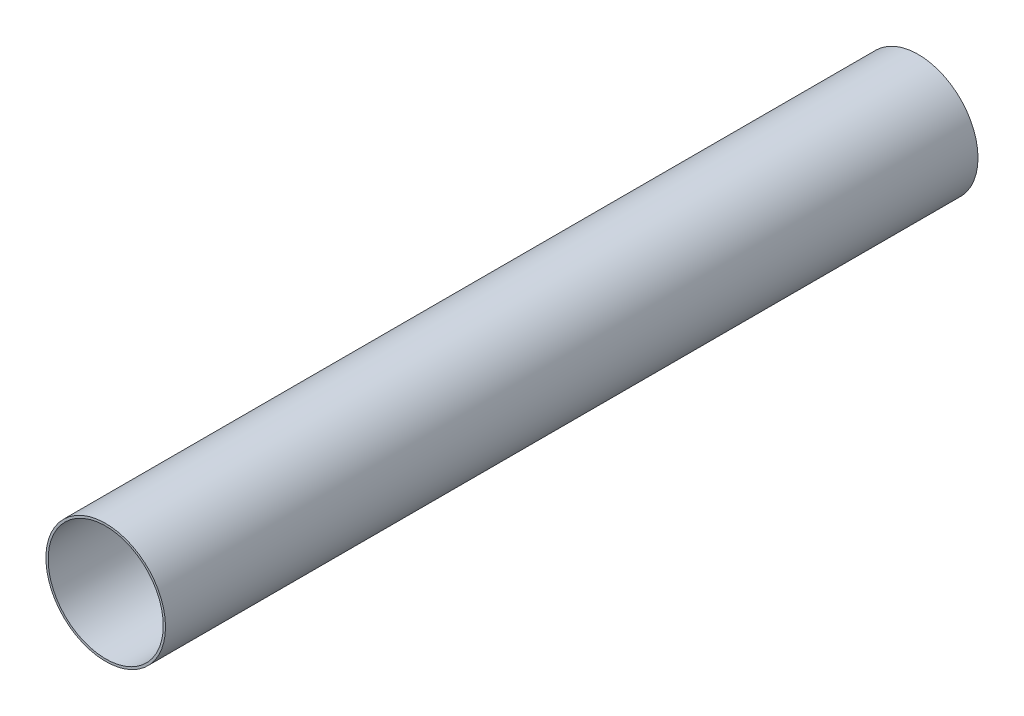
ISO-10303-21;
HEADER;
FILE_DESCRIPTION(('STEP AP214'),'2;1');
FILE_NAME('part.step','',(''),(''),'','','');
FILE_SCHEMA(('AUTOMOTIVE_DESIGN { 1 0 10303 214 1 1 1 1 }'));
ENDSEC;
DATA;
#1=APPLICATION_CONTEXT('core data for automotive mechanical design processes');
#2=APPLICATION_PROTOCOL_DEFINITION('international standard','automotive_design',2000,#1);
#3=PRODUCT_CONTEXT('',#1,'mechanical');
#4=PRODUCT('Part','Part','',(#3));
#5=PRODUCT_RELATED_PRODUCT_CATEGORY('part','',(#4));
#6=PRODUCT_DEFINITION_FORMATION('','',#4);
#7=PRODUCT_DEFINITION_CONTEXT('part definition',#1,'design');
#8=PRODUCT_DEFINITION('design','',#6,#7);
#9=PRODUCT_DEFINITION_SHAPE('','',#8);
#10=(LENGTH_UNIT() NAMED_UNIT(*) SI_UNIT(.MILLI.,.METRE.));
#11=(NAMED_UNIT(*) PLANE_ANGLE_UNIT() SI_UNIT($,.RADIAN.));
#12=(NAMED_UNIT(*) SI_UNIT($,.STERADIAN.) SOLID_ANGLE_UNIT());
#13=UNCERTAINTY_MEASURE_WITH_UNIT(LENGTH_MEASURE(1.E-05),#10,'distance_accuracy_value','');
#14=(GEOMETRIC_REPRESENTATION_CONTEXT(3) GLOBAL_UNCERTAINTY_ASSIGNED_CONTEXT((#13)) GLOBAL_UNIT_ASSIGNED_CONTEXT((#10,
#11,#12)) REPRESENTATION_CONTEXT('',''));
#15=CARTESIAN_POINT('',(0.,0.,0.));
#16=DIRECTION('',(0.,0.,1.));
#17=DIRECTION('',(1.,0.,0.));
#18=AXIS2_PLACEMENT_3D('',#15,#16,#17);
#19=CARTESIAN_POINT('',(0.,0.,914.4));
#20=DIRECTION('',(0.,0.,1.));
#21=DIRECTION('',(1.,0.,0.));
#22=AXIS2_PLACEMENT_3D('',#19,#20,#21);
#23=PLANE('',#22);
#24=CARTESIAN_POINT('',(0.,0.,914.4));
#25=DIRECTION('',(0.,0.,1.));
#26=DIRECTION('',(1.,0.,0.));
#27=AXIS2_PLACEMENT_3D('',#24,#25,#26);
#28=CIRCLE('',#27,67.31);
#29=CARTESIAN_POINT('',(67.31,0.,914.4));
#30=VERTEX_POINT('',#29);
#31=EDGE_CURVE('E10',#30,#30,#28,.T.);
#32=ORIENTED_EDGE('',*,*,#31,.T.);
#33=EDGE_LOOP('',(#32));
#34=FACE_BOUND('',#33,.T.);
#35=CARTESIAN_POINT('',(0.,0.,914.4));
#36=DIRECTION('',(0.,0.,1.));
#37=DIRECTION('',(1.,0.,0.));
#38=AXIS2_PLACEMENT_3D('',#35,#36,#37);
#39=CIRCLE('',#38,64.77);
#40=CARTESIAN_POINT('',(64.77,0.,914.4));
#41=VERTEX_POINT('',#40);
#42=EDGE_CURVE('E46',#41,#41,#39,.T.);
#43=ORIENTED_EDGE('',*,*,#42,.F.);
#44=EDGE_LOOP('',(#43));
#45=FACE_BOUND('',#44,.T.);
#46=ADVANCED_FACE('F35',(#34,#45),#23,.T.);
#47=CARTESIAN_POINT('',(0.,0.,0.));
#48=DIRECTION('',(0.,0.,1.));
#49=DIRECTION('',(1.,0.,0.));
#50=AXIS2_PLACEMENT_3D('',#47,#48,#49);
#51=PLANE('',#50);
#52=CARTESIAN_POINT('',(0.,0.,0.));
#53=DIRECTION('',(0.,0.,1.));
#54=DIRECTION('',(1.,0.,0.));
#55=AXIS2_PLACEMENT_3D('',#52,#53,#54);
#56=CIRCLE('',#55,67.31);
#57=CARTESIAN_POINT('',(67.31,0.,0.));
#58=VERTEX_POINT('',#57);
#59=EDGE_CURVE('E39',#58,#58,#56,.T.);
#60=ORIENTED_EDGE('',*,*,#59,.F.);
#61=EDGE_LOOP('',(#60));
#62=FACE_BOUND('',#61,.T.);
#63=CARTESIAN_POINT('',(0.,0.,0.));
#64=DIRECTION('',(0.,0.,1.));
#65=DIRECTION('',(1.,0.,0.));
#66=AXIS2_PLACEMENT_3D('',#63,#64,#65);
#67=CIRCLE('',#66,64.77);
#68=CARTESIAN_POINT('',(64.77,0.,0.));
#69=VERTEX_POINT('',#68);
#70=EDGE_CURVE('E48',#69,#69,#67,.T.);
#71=ORIENTED_EDGE('',*,*,#70,.T.);
#72=EDGE_LOOP('',(#71));
#73=FACE_BOUND('',#72,.T.);
#74=ADVANCED_FACE('F58',(#62,#73),#51,.F.);
#75=CARTESIAN_POINT('',(0.,0.,914.4));
#76=DIRECTION('',(0.,0.,-1.));
#77=DIRECTION('',(-1.,0.,0.));
#78=AXIS2_PLACEMENT_3D('',#75,#76,#77);
#79=CYLINDRICAL_SURFACE('',#78,67.31);
#80=ORIENTED_EDGE('',*,*,#31,.F.);
#81=EDGE_LOOP('',(#80));
#82=FACE_BOUND('',#81,.T.);
#83=ORIENTED_EDGE('',*,*,#59,.T.);
#84=EDGE_LOOP('',(#83));
#85=FACE_BOUND('',#84,.T.);
#86=ADVANCED_FACE('F37',(#82,#85),#79,.T.);
#87=CARTESIAN_POINT('',(0.,0.,914.4));
#88=DIRECTION('',(0.,0.,-1.));
#89=DIRECTION('',(-1.,0.,0.));
#90=AXIS2_PLACEMENT_3D('',#87,#88,#89);
#91=CYLINDRICAL_SURFACE('',#90,64.77);
#92=ORIENTED_EDGE('',*,*,#42,.T.);
#93=EDGE_LOOP('',(#92));
#94=FACE_BOUND('',#93,.T.);
#95=ORIENTED_EDGE('',*,*,#70,.F.);
#96=EDGE_LOOP('',(#95));
#97=FACE_BOUND('',#96,.T.);
#98=ADVANCED_FACE('F54',(#94,#97),#91,.F.);
#99=CLOSED_SHELL('',(#46,#74,#86,#98));
#100=MANIFOLD_SOLID_BREP('B2',#99);
#101=ADVANCED_BREP_SHAPE_REPRESENTATION('',(#18,#100),#14);
#102=SHAPE_DEFINITION_REPRESENTATION(#9,#101);
ENDSEC;
END-ISO-10303-21;
